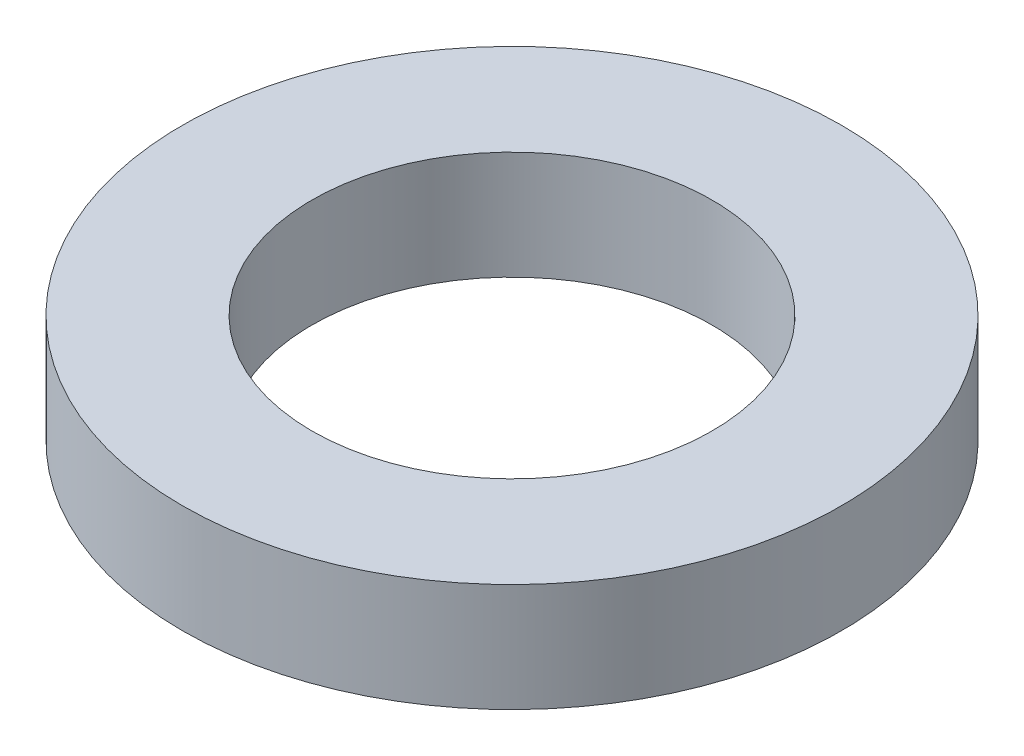
ISO-10303-21;
HEADER;
FILE_DESCRIPTION(('STEP AP214'),'2;1');
FILE_NAME('part.step','',(''),(''),'','','');
FILE_SCHEMA(('AUTOMOTIVE_DESIGN { 1 0 10303 214 1 1 1 1 }'));
ENDSEC;
DATA;
#1=APPLICATION_CONTEXT('core data for automotive mechanical design processes');
#2=APPLICATION_PROTOCOL_DEFINITION('international standard','automotive_design',2000,#1);
#3=PRODUCT_CONTEXT('',#1,'mechanical');
#4=PRODUCT('Part','Part','',(#3));
#5=PRODUCT_RELATED_PRODUCT_CATEGORY('part','',(#4));
#6=PRODUCT_DEFINITION_FORMATION('','',#4);
#7=PRODUCT_DEFINITION_CONTEXT('part definition',#1,'design');
#8=PRODUCT_DEFINITION('design','',#6,#7);
#9=PRODUCT_DEFINITION_SHAPE('','',#8);
#10=(LENGTH_UNIT() NAMED_UNIT(*) SI_UNIT(.MILLI.,.METRE.));
#11=(NAMED_UNIT(*) PLANE_ANGLE_UNIT() SI_UNIT($,.RADIAN.));
#12=(NAMED_UNIT(*) SI_UNIT($,.STERADIAN.) SOLID_ANGLE_UNIT());
#13=UNCERTAINTY_MEASURE_WITH_UNIT(LENGTH_MEASURE(1.E-05),#10,'distance_accuracy_value','');
#14=(GEOMETRIC_REPRESENTATION_CONTEXT(3) GLOBAL_UNCERTAINTY_ASSIGNED_CONTEXT((#13)) GLOBAL_UNIT_ASSIGNED_CONTEXT((#10,
#11,#12)) REPRESENTATION_CONTEXT('',''));
#15=CARTESIAN_POINT('',(0.,0.,0.));
#16=DIRECTION('',(0.,0.,1.));
#17=DIRECTION('',(1.,0.,0.));
#18=AXIS2_PLACEMENT_3D('',#15,#16,#17);
#19=CARTESIAN_POINT('',(0.,23.,0.));
#20=DIRECTION('',(0.,-1.,0.));
#21=DIRECTION('',(0.,0.,-1.));
#22=AXIS2_PLACEMENT_3D('',#19,#20,#21);
#23=CYLINDRICAL_SURFACE('',#22,70.);
#24=CARTESIAN_POINT('',(0.,23.,0.));
#25=DIRECTION('',(0.,1.,0.));
#26=DIRECTION('',(0.,0.,1.));
#27=AXIS2_PLACEMENT_3D('',#24,#25,#26);
#28=CIRCLE('',#27,70.);
#29=CARTESIAN_POINT('',(0.,23.,70.));
#30=VERTEX_POINT('',#29);
#31=EDGE_CURVE('E10',#30,#30,#28,.T.);
#32=ORIENTED_EDGE('',*,*,#31,.F.);
#33=EDGE_LOOP('',(#32));
#34=FACE_BOUND('',#33,.T.);
#35=CARTESIAN_POINT('',(0.,0.,0.));
#36=DIRECTION('',(0.,1.,0.));
#37=DIRECTION('',(0.,0.,1.));
#38=AXIS2_PLACEMENT_3D('',#35,#36,#37);
#39=CIRCLE('',#38,70.);
#40=CARTESIAN_POINT('',(0.,0.,70.));
#41=VERTEX_POINT('',#40);
#42=EDGE_CURVE('E37',#41,#41,#39,.T.);
#43=ORIENTED_EDGE('',*,*,#42,.T.);
#44=EDGE_LOOP('',(#43));
#45=FACE_BOUND('',#44,.T.);
#46=ADVANCED_FACE('F40',(#34,#45),#23,.T.);
#47=CARTESIAN_POINT('',(0.,23.,0.));
#48=DIRECTION('',(0.,1.,0.));
#49=DIRECTION('',(0.,0.,1.));
#50=AXIS2_PLACEMENT_3D('',#47,#48,#49);
#51=PLANE('',#50);
#52=CARTESIAN_POINT('',(0.,23.,0.));
#53=DIRECTION('',(0.,1.,0.));
#54=DIRECTION('',(0.,0.,1.));
#55=AXIS2_PLACEMENT_3D('',#52,#53,#54);
#56=CIRCLE('',#55,42.5);
#57=CARTESIAN_POINT('',(0.,23.,42.5));
#58=VERTEX_POINT('',#57);
#59=EDGE_CURVE('E50',#58,#58,#56,.T.);
#60=ORIENTED_EDGE('',*,*,#59,.F.);
#61=EDGE_LOOP('',(#60));
#62=FACE_BOUND('',#61,.T.);
#63=ORIENTED_EDGE('',*,*,#31,.T.);
#64=EDGE_LOOP('',(#63));
#65=FACE_BOUND('',#64,.T.);
#66=ADVANCED_FACE('F59',(#62,#65),#51,.T.);
#67=CARTESIAN_POINT('',(0.,0.,0.));
#68=DIRECTION('',(0.,1.,0.));
#69=DIRECTION('',(0.,0.,1.));
#70=AXIS2_PLACEMENT_3D('',#67,#68,#69);
#71=PLANE('',#70);
#72=CARTESIAN_POINT('',(0.,0.,0.));
#73=DIRECTION('',(0.,1.,0.));
#74=DIRECTION('',(0.,0.,1.));
#75=AXIS2_PLACEMENT_3D('',#72,#73,#74);
#76=CIRCLE('',#75,42.5);
#77=CARTESIAN_POINT('',(0.,0.,42.5));
#78=VERTEX_POINT('',#77);
#79=EDGE_CURVE('E47',#78,#78,#76,.T.);
#80=ORIENTED_EDGE('',*,*,#79,.T.);
#81=EDGE_LOOP('',(#80));
#82=FACE_BOUND('',#81,.T.);
#83=ORIENTED_EDGE('',*,*,#42,.F.);
#84=EDGE_LOOP('',(#83));
#85=FACE_BOUND('',#84,.T.);
#86=ADVANCED_FACE('F58',(#82,#85),#71,.F.);
#87=CARTESIAN_POINT('',(0.,23.,0.));
#88=DIRECTION('',(0.,-1.,0.));
#89=DIRECTION('',(0.,0.,-1.));
#90=AXIS2_PLACEMENT_3D('',#87,#88,#89);
#91=CYLINDRICAL_SURFACE('',#90,42.5);
#92=ORIENTED_EDGE('',*,*,#59,.T.);
#93=EDGE_LOOP('',(#92));
#94=FACE_BOUND('',#93,.T.);
#95=ORIENTED_EDGE('',*,*,#79,.F.);
#96=EDGE_LOOP('',(#95));
#97=FACE_BOUND('',#96,.T.);
#98=ADVANCED_FACE('F54',(#94,#97),#91,.F.);
#99=CLOSED_SHELL('',(#46,#66,#86,#98));
#100=MANIFOLD_SOLID_BREP('B2',#99);
#101=ADVANCED_BREP_SHAPE_REPRESENTATION('',(#18,#100),#14);
#102=SHAPE_DEFINITION_REPRESENTATION(#9,#101);
ENDSEC;
END-ISO-10303-21;
